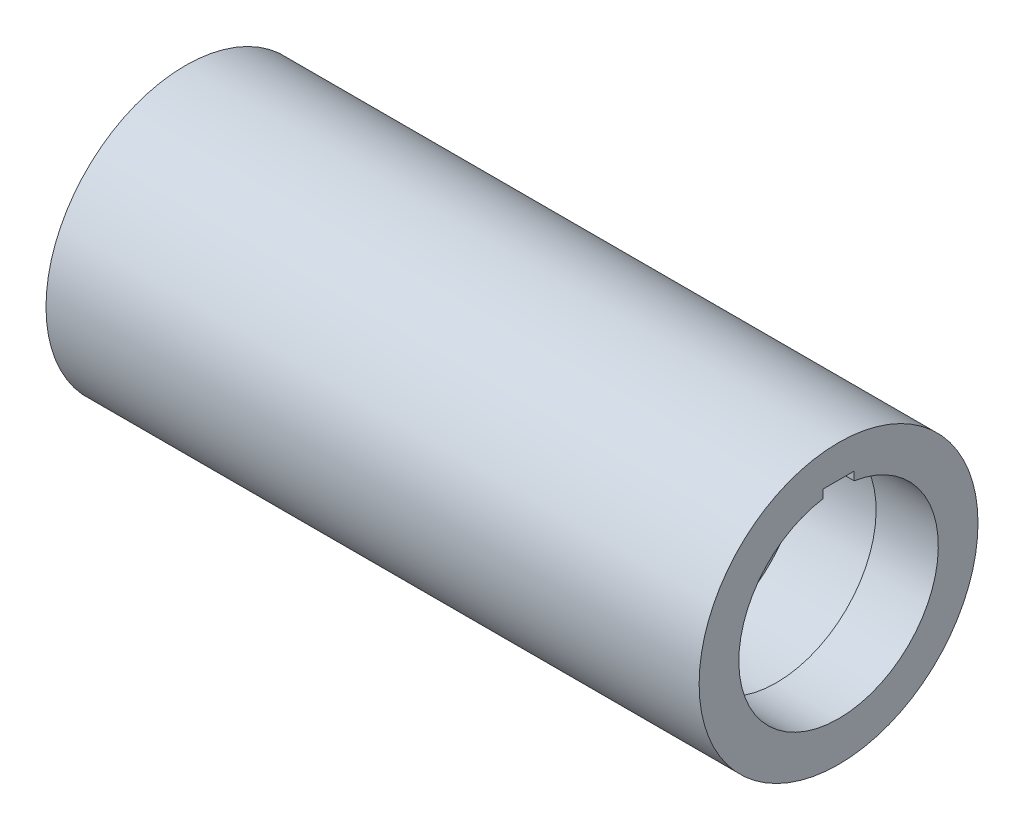
ISO-10303-21;
HEADER;
FILE_DESCRIPTION(('STEP AP214'),'2;1');
FILE_NAME('part.step','',(''),(''),'','','');
FILE_SCHEMA(('AUTOMOTIVE_DESIGN { 1 0 10303 214 1 1 1 1 }'));
ENDSEC;
DATA;
#1=APPLICATION_CONTEXT('core data for automotive mechanical design processes');
#2=APPLICATION_PROTOCOL_DEFINITION('international standard','automotive_design',2000,#1);
#3=PRODUCT_CONTEXT('',#1,'mechanical');
#4=PRODUCT('Part','Part','',(#3));
#5=PRODUCT_RELATED_PRODUCT_CATEGORY('part','',(#4));
#6=PRODUCT_DEFINITION_FORMATION('','',#4);
#7=PRODUCT_DEFINITION_CONTEXT('part definition',#1,'design');
#8=PRODUCT_DEFINITION('design','',#6,#7);
#9=PRODUCT_DEFINITION_SHAPE('','',#8);
#10=(LENGTH_UNIT() NAMED_UNIT(*) SI_UNIT(.MILLI.,.METRE.));
#11=(NAMED_UNIT(*) PLANE_ANGLE_UNIT() SI_UNIT($,.RADIAN.));
#12=(NAMED_UNIT(*) SI_UNIT($,.STERADIAN.) SOLID_ANGLE_UNIT());
#13=UNCERTAINTY_MEASURE_WITH_UNIT(LENGTH_MEASURE(1.E-05),#10,'distance_accuracy_value','');
#14=(GEOMETRIC_REPRESENTATION_CONTEXT(3) GLOBAL_UNCERTAINTY_ASSIGNED_CONTEXT((#13)) GLOBAL_UNIT_ASSIGNED_CONTEXT((#10,
#11,#12)) REPRESENTATION_CONTEXT('',''));
#15=CARTESIAN_POINT('',(0.,0.,0.));
#16=DIRECTION('',(0.,0.,1.));
#17=DIRECTION('',(1.,0.,0.));
#18=AXIS2_PLACEMENT_3D('',#15,#16,#17);
#19=CARTESIAN_POINT('',(-31.5,9.62162085033772,0.));
#20=DIRECTION('',(1.,0.,0.));
#21=DIRECTION('',(0.,0.,-1.));
#22=AXIS2_PLACEMENT_3D('',#19,#20,#21);
#23=PLANE('',#22);
#24=CARTESIAN_POINT('',(-31.5,0.,0.));
#25=DIRECTION('',(-1.,0.,0.));
#26=DIRECTION('',(0.,0.,1.));
#27=AXIS2_PLACEMENT_3D('',#24,#25,#26);
#28=CIRCLE('',#27,9.62162085033772);
#29=CARTESIAN_POINT('',(-31.5,9.50397747196687,-1.5));
#30=VERTEX_POINT('',#29);
#31=CARTESIAN_POINT('',(-31.5,9.50397747196687,1.5));
#32=VERTEX_POINT('',#31);
#33=EDGE_CURVE('E135',#30,#32,#28,.T.);
#34=ORIENTED_EDGE('',*,*,#33,.F.);
#35=DIRECTION('',(0.,1.,0.));
#36=VECTOR('',#35,1.);
#37=CARTESIAN_POINT('',(-31.5,10.3118691564843,-1.5));
#38=LINE('',#37,#36);
#39=CARTESIAN_POINT('',(-31.5,10.3118691564843,-1.5));
#40=VERTEX_POINT('',#39);
#41=EDGE_CURVE('E116',#30,#40,#38,.T.);
#42=ORIENTED_EDGE('',*,*,#41,.T.);
#43=DIRECTION('',(0.,0.,1.));
#44=VECTOR('',#43,1.);
#45=CARTESIAN_POINT('',(-31.5,10.3118691564843,1.5));
#46=LINE('',#45,#44);
#47=CARTESIAN_POINT('',(-31.5,10.3118691564843,1.5));
#48=VERTEX_POINT('',#47);
#49=EDGE_CURVE('E124',#40,#48,#46,.T.);
#50=ORIENTED_EDGE('',*,*,#49,.T.);
#51=DIRECTION('',(0.,-1.,0.));
#52=VECTOR('',#51,1.);
#53=CARTESIAN_POINT('',(-31.5,10.3118691564843,1.5));
#54=LINE('',#53,#52);
#55=EDGE_CURVE('E130',#48,#32,#54,.T.);
#56=ORIENTED_EDGE('',*,*,#55,.T.);
#57=EDGE_LOOP('',(#34,#42,#50,#56));
#58=FACE_BOUND('',#57,.T.);
#59=CARTESIAN_POINT('',(-31.5,0.,0.));
#60=DIRECTION('',(-1.,0.,0.));
#61=DIRECTION('',(0.,0.,1.));
#62=AXIS2_PLACEMENT_3D('',#59,#60,#61);
#63=CIRCLE('',#62,13.45);
#64=CARTESIAN_POINT('',(-31.5,0.,13.45));
#65=VERTEX_POINT('',#64);
#66=EDGE_CURVE('E183',#65,#65,#63,.T.);
#67=ORIENTED_EDGE('',*,*,#66,.T.);
#68=EDGE_LOOP('',(#67));
#69=FACE_BOUND('',#68,.T.);
#70=ADVANCED_FACE('F48',(#58,#69),#23,.F.);
#71=CARTESIAN_POINT('',(-66.372744642719,0.,0.));
#72=DIRECTION('',(-1.,0.,0.));
#73=DIRECTION('',(0.,0.,1.));
#74=AXIS2_PLACEMENT_3D('',#71,#72,#73);
#75=CYLINDRICAL_SURFACE('',#74,13.45);
#76=ORIENTED_EDGE('',*,*,#66,.F.);
#77=EDGE_LOOP('',(#76));
#78=FACE_BOUND('',#77,.T.);
#79=CARTESIAN_POINT('',(31.5,0.,0.));
#80=DIRECTION('',(-1.,0.,0.));
#81=DIRECTION('',(0.,0.,1.));
#82=AXIS2_PLACEMENT_3D('',#79,#80,#81);
#83=CIRCLE('',#82,13.45);
#84=CARTESIAN_POINT('',(31.5,0.,13.45));
#85=VERTEX_POINT('',#84);
#86=EDGE_CURVE('E180',#85,#85,#83,.T.);
#87=ORIENTED_EDGE('',*,*,#86,.T.);
#88=EDGE_LOOP('',(#87));
#89=FACE_BOUND('',#88,.T.);
#90=ADVANCED_FACE('F207',(#78,#89),#75,.T.);
#91=CARTESIAN_POINT('',(31.5,13.45,0.));
#92=DIRECTION('',(-1.,0.,0.));
#93=DIRECTION('',(0.,0.,1.));
#94=AXIS2_PLACEMENT_3D('',#91,#92,#93);
#95=PLANE('',#94);
#96=ORIENTED_EDGE('',*,*,#86,.F.);
#97=EDGE_LOOP('',(#96));
#98=FACE_BOUND('',#97,.T.);
#99=DIRECTION('',(0.,0.,1.));
#100=VECTOR('',#99,1.);
#101=CARTESIAN_POINT('',(31.5,10.3118691564843,1.5));
#102=LINE('',#101,#100);
#103=CARTESIAN_POINT('',(31.5,10.3118691564843,-1.5));
#104=VERTEX_POINT('',#103);
#105=CARTESIAN_POINT('',(31.5,10.3118691564843,1.5));
#106=VERTEX_POINT('',#105);
#107=EDGE_CURVE('E138',#104,#106,#102,.T.);
#108=ORIENTED_EDGE('',*,*,#107,.F.);
#109=DIRECTION('',(0.,1.,0.));
#110=VECTOR('',#109,1.);
#111=CARTESIAN_POINT('',(31.5,10.3118691564843,-1.5));
#112=LINE('',#111,#110);
#113=CARTESIAN_POINT('',(31.5,9.50397747196687,-1.5));
#114=VERTEX_POINT('',#113);
#115=EDGE_CURVE('E142',#114,#104,#112,.T.);
#116=ORIENTED_EDGE('',*,*,#115,.F.);
#117=CARTESIAN_POINT('',(31.5,0.,0.));
#118=DIRECTION('',(-1.,0.,0.));
#119=DIRECTION('',(0.,0.,1.));
#120=AXIS2_PLACEMENT_3D('',#117,#118,#119);
#121=CIRCLE('',#120,9.62162085033772);
#122=CARTESIAN_POINT('',(31.5,9.50397747196687,1.5));
#123=VERTEX_POINT('',#122);
#124=EDGE_CURVE('E177',#114,#123,#121,.T.);
#125=ORIENTED_EDGE('',*,*,#124,.T.);
#126=DIRECTION('',(0.,-1.,0.));
#127=VECTOR('',#126,1.);
#128=CARTESIAN_POINT('',(31.5,10.3118691564843,1.5));
#129=LINE('',#128,#127);
#130=EDGE_CURVE('E136',#106,#123,#129,.T.);
#131=ORIENTED_EDGE('',*,*,#130,.F.);
#132=EDGE_LOOP('',(#108,#116,#125,#131));
#133=FACE_BOUND('',#132,.T.);
#134=ADVANCED_FACE('F211',(#98,#133),#95,.F.);
#135=CARTESIAN_POINT('',(-66.372744642719,0.,0.));
#136=DIRECTION('',(-1.,0.,0.));
#137=DIRECTION('',(0.,0.,1.));
#138=AXIS2_PLACEMENT_3D('',#135,#136,#137);
#139=CYLINDRICAL_SURFACE('',#138,9.62162085033773);
#140=ORIENTED_EDGE('',*,*,#124,.F.);
#141=DIRECTION('',(-1.,0.,0.));
#142=VECTOR('',#141,1.);
#143=CARTESIAN_POINT('',(-66.372744642719,9.50397747196687,-1.5));
#144=LINE('',#143,#142);
#145=CARTESIAN_POINT('',(25.5,9.50397747196688,-1.5));
#146=VERTEX_POINT('',#145);
#147=EDGE_CURVE('E158',#114,#146,#144,.T.);
#148=ORIENTED_EDGE('',*,*,#147,.T.);
#149=CARTESIAN_POINT('',(25.5,0.,0.));
#150=DIRECTION('',(-1.,0.,0.));
#151=DIRECTION('',(0.,0.,1.));
#152=AXIS2_PLACEMENT_3D('',#149,#150,#151);
#153=CIRCLE('',#152,9.62162085033775);
#154=CARTESIAN_POINT('',(25.5,9.50397747196688,1.5));
#155=VERTEX_POINT('',#154);
#156=EDGE_CURVE('E174',#146,#155,#153,.T.);
#157=ORIENTED_EDGE('',*,*,#156,.T.);
#158=DIRECTION('',(-1.,0.,0.));
#159=VECTOR('',#158,1.);
#160=CARTESIAN_POINT('',(-66.372744642719,9.50397747196687,1.5));
#161=LINE('',#160,#159);
#162=EDGE_CURVE('E151',#155,#123,#161,.F.);
#163=ORIENTED_EDGE('',*,*,#162,.T.);
#164=EDGE_LOOP('',(#140,#148,#157,#163));
#165=FACE_BOUND('',#164,.T.);
#166=ADVANCED_FACE('F216',(#165),#139,.F.);
#167=CARTESIAN_POINT('',(25.5,9.62162085033775,0.));
#168=DIRECTION('',(1.,0.,0.));
#169=DIRECTION('',(0.,0.,-1.));
#170=AXIS2_PLACEMENT_3D('',#167,#168,#169);
#171=PLANE('',#170);
#172=ORIENTED_EDGE('',*,*,#156,.F.);
#173=DIRECTION('',(0.,1.,0.));
#174=VECTOR('',#173,1.);
#175=CARTESIAN_POINT('',(25.5,9.62162085033775,-1.5));
#176=LINE('',#175,#174);
#177=CARTESIAN_POINT('',(25.5,10.3118691564843,-1.5));
#178=VERTEX_POINT('',#177);
#179=EDGE_CURVE('E155',#146,#178,#176,.T.);
#180=ORIENTED_EDGE('',*,*,#179,.T.);
#181=DIRECTION('',(0.,0.,1.));
#182=VECTOR('',#181,1.);
#183=CARTESIAN_POINT('',(25.5,10.3118691564843,0.));
#184=LINE('',#183,#182);
#185=CARTESIAN_POINT('',(25.5,10.3118691564843,1.5));
#186=VERTEX_POINT('',#185);
#187=EDGE_CURVE('E161',#178,#186,#184,.T.);
#188=ORIENTED_EDGE('',*,*,#187,.T.);
#189=DIRECTION('',(0.,-1.,0.));
#190=VECTOR('',#189,1.);
#191=CARTESIAN_POINT('',(25.5,9.62162085033775,1.5));
#192=LINE('',#191,#190);
#193=EDGE_CURVE('E148',#186,#155,#192,.T.);
#194=ORIENTED_EDGE('',*,*,#193,.T.);
#195=EDGE_LOOP('',(#172,#180,#188,#194));
#196=FACE_BOUND('',#195,.T.);
#197=CARTESIAN_POINT('',(25.5,0.,0.));
#198=DIRECTION('',(-1.,0.,0.));
#199=DIRECTION('',(0.,0.,1.));
#200=AXIS2_PLACEMENT_3D('',#197,#198,#199);
#201=CIRCLE('',#200,10.4216208503377);
#202=CARTESIAN_POINT('',(25.5,0.,10.4216208503377));
#203=VERTEX_POINT('',#202);
#204=EDGE_CURVE('E171',#203,#203,#201,.T.);
#205=ORIENTED_EDGE('',*,*,#204,.T.);
#206=EDGE_LOOP('',(#205));
#207=FACE_BOUND('',#206,.T.);
#208=ADVANCED_FACE('F224',(#196,#207),#171,.F.);
#209=CARTESIAN_POINT('',(-66.372744642719,0.,0.));
#210=DIRECTION('',(-1.,0.,0.));
#211=DIRECTION('',(0.,0.,1.));
#212=AXIS2_PLACEMENT_3D('',#209,#210,#211);
#213=CYLINDRICAL_SURFACE('',#212,10.4216208503377);
#214=ORIENTED_EDGE('',*,*,#204,.F.);
#215=EDGE_LOOP('',(#214));
#216=FACE_BOUND('',#215,.T.);
#217=CARTESIAN_POINT('',(17.5,0.,0.));
#218=DIRECTION('',(-1.,0.,0.));
#219=DIRECTION('',(0.,0.,1.));
#220=AXIS2_PLACEMENT_3D('',#217,#218,#219);
#221=CIRCLE('',#220,10.4216208503377);
#222=CARTESIAN_POINT('',(17.5,0.,10.4216208503377));
#223=VERTEX_POINT('',#222);
#224=EDGE_CURVE('E168',#223,#223,#221,.T.);
#225=ORIENTED_EDGE('',*,*,#224,.T.);
#226=EDGE_LOOP('',(#225));
#227=FACE_BOUND('',#226,.T.);
#228=ADVANCED_FACE('F228',(#216,#227),#213,.F.);
#229=CARTESIAN_POINT('',(17.5,10.4216208503377,0.));
#230=DIRECTION('',(-1.,0.,0.));
#231=DIRECTION('',(0.,0.,1.));
#232=AXIS2_PLACEMENT_3D('',#229,#230,#231);
#233=PLANE('',#232);
#234=ORIENTED_EDGE('',*,*,#224,.F.);
#235=EDGE_LOOP('',(#234));
#236=FACE_BOUND('',#235,.T.);
#237=DIRECTION('',(0.,0.,-1.));
#238=VECTOR('',#237,1.);
#239=CARTESIAN_POINT('',(17.5,10.3118691564843,0.));
#240=LINE('',#239,#238);
#241=CARTESIAN_POINT('',(17.5,10.3118691564843,1.5));
#242=VERTEX_POINT('',#241);
#243=CARTESIAN_POINT('',(17.5,10.3118691564843,-1.5));
#244=VERTEX_POINT('',#243);
#245=EDGE_CURVE('E13',#242,#244,#240,.T.);
#246=ORIENTED_EDGE('',*,*,#245,.T.);
#247=DIRECTION('',(0.,-1.,0.));
#248=VECTOR('',#247,1.);
#249=CARTESIAN_POINT('',(17.5,10.4216208503377,-1.5));
#250=LINE('',#249,#248);
#251=CARTESIAN_POINT('',(17.5,9.50397747196687,-1.5));
#252=VERTEX_POINT('',#251);
#253=EDGE_CURVE('E119',#244,#252,#250,.T.);
#254=ORIENTED_EDGE('',*,*,#253,.T.);
#255=CARTESIAN_POINT('',(17.5,0.,0.));
#256=DIRECTION('',(-1.,0.,0.));
#257=DIRECTION('',(0.,0.,1.));
#258=AXIS2_PLACEMENT_3D('',#255,#256,#257);
#259=CIRCLE('',#258,9.62162085033775);
#260=CARTESIAN_POINT('',(17.5,9.50397747196688,1.5));
#261=VERTEX_POINT('',#260);
#262=EDGE_CURVE('E165',#252,#261,#259,.T.);
#263=ORIENTED_EDGE('',*,*,#262,.T.);
#264=DIRECTION('',(0.,1.,0.));
#265=VECTOR('',#264,1.);
#266=CARTESIAN_POINT('',(17.5,10.4216208503377,1.5));
#267=LINE('',#266,#265);
#268=EDGE_CURVE('E70',#261,#242,#267,.T.);
#269=ORIENTED_EDGE('',*,*,#268,.T.);
#270=EDGE_LOOP('',(#246,#254,#263,#269));
#271=FACE_BOUND('',#270,.T.);
#272=ADVANCED_FACE('F191',(#236,#271),#233,.F.);
#273=CARTESIAN_POINT('',(-66.372744642719,0.,0.));
#274=DIRECTION('',(-1.,0.,0.));
#275=DIRECTION('',(0.,0.,1.));
#276=AXIS2_PLACEMENT_3D('',#273,#274,#275);
#277=CYLINDRICAL_SURFACE('',#276,9.62162085033773);
#278=ORIENTED_EDGE('',*,*,#262,.F.);
#279=DIRECTION('',(-1.,0.,0.));
#280=VECTOR('',#279,1.);
#281=CARTESIAN_POINT('',(-66.372744642719,9.50397747196687,-1.5));
#282=LINE('',#281,#280);
#283=EDGE_CURVE('E55',#252,#30,#282,.T.);
#284=ORIENTED_EDGE('',*,*,#283,.T.);
#285=ORIENTED_EDGE('',*,*,#33,.T.);
#286=DIRECTION('',(-1.,0.,0.));
#287=VECTOR('',#286,1.);
#288=CARTESIAN_POINT('',(-66.372744642719,9.50397747196687,1.5));
#289=LINE('',#288,#287);
#290=EDGE_CURVE('E186',#32,#261,#289,.F.);
#291=ORIENTED_EDGE('',*,*,#290,.T.);
#292=EDGE_LOOP('',(#278,#284,#285,#291));
#293=FACE_BOUND('',#292,.T.);
#294=ADVANCED_FACE('F189',(#293),#277,.F.);
#295=CARTESIAN_POINT('',(-31.5,10.3118691564843,-1.5));
#296=DIRECTION('',(0.,0.,-1.));
#297=DIRECTION('',(0.,1.,0.));
#298=AXIS2_PLACEMENT_3D('',#295,#296,#297);
#299=PLANE('',#298);
#300=DIRECTION('',(1.,0.,0.));
#301=VECTOR('',#300,1.);
#302=CARTESIAN_POINT('',(-31.5,10.3118691564843,-1.5));
#303=LINE('',#302,#301);
#304=EDGE_CURVE('E112',#40,#244,#303,.T.);
#305=ORIENTED_EDGE('',*,*,#304,.F.);
#306=ORIENTED_EDGE('',*,*,#41,.F.);
#307=ORIENTED_EDGE('',*,*,#283,.F.);
#308=ORIENTED_EDGE('',*,*,#253,.F.);
#309=EDGE_LOOP('',(#305,#306,#307,#308));
#310=FACE_BOUND('',#309,.T.);
#311=ADVANCED_FACE('F114',(#310),#299,.F.);
#312=CARTESIAN_POINT('',(-31.5,10.3118691564843,1.5));
#313=DIRECTION('',(0.,0.,1.));
#314=DIRECTION('',(0.,-1.,0.));
#315=AXIS2_PLACEMENT_3D('',#312,#313,#314);
#316=PLANE('',#315);
#317=ORIENTED_EDGE('',*,*,#290,.F.);
#318=ORIENTED_EDGE('',*,*,#55,.F.);
#319=DIRECTION('',(1.,0.,0.));
#320=VECTOR('',#319,1.);
#321=CARTESIAN_POINT('',(-31.5,10.3118691564843,1.5));
#322=LINE('',#321,#320);
#323=EDGE_CURVE('E126',#48,#242,#322,.T.);
#324=ORIENTED_EDGE('',*,*,#323,.T.);
#325=ORIENTED_EDGE('',*,*,#268,.F.);
#326=EDGE_LOOP('',(#317,#318,#324,#325));
#327=FACE_BOUND('',#326,.T.);
#328=ADVANCED_FACE('F192',(#327),#316,.F.);
#329=CARTESIAN_POINT('',(-31.5,10.3118691564843,1.5));
#330=DIRECTION('',(0.,1.,0.));
#331=DIRECTION('',(0.,0.,1.));
#332=AXIS2_PLACEMENT_3D('',#329,#330,#331);
#333=PLANE('',#332);
#334=ORIENTED_EDGE('',*,*,#323,.F.);
#335=ORIENTED_EDGE('',*,*,#49,.F.);
#336=ORIENTED_EDGE('',*,*,#304,.T.);
#337=ORIENTED_EDGE('',*,*,#245,.F.);
#338=EDGE_LOOP('',(#334,#335,#336,#337));
#339=FACE_BOUND('',#338,.T.);
#340=ADVANCED_FACE('F125',(#339),#333,.F.);
#341=EDGE_CURVE('E121',#178,#104,#303,.T.);
#342=ORIENTED_EDGE('',*,*,#341,.T.);
#343=ORIENTED_EDGE('',*,*,#107,.T.);
#344=EDGE_CURVE('E62',#186,#106,#322,.T.);
#345=ORIENTED_EDGE('',*,*,#344,.F.);
#346=ORIENTED_EDGE('',*,*,#187,.F.);
#347=EDGE_LOOP('',(#342,#343,#345,#346));
#348=FACE_BOUND('',#347,.T.);
#349=ADVANCED_FACE('F200',(#348),#333,.F.);
#350=ORIENTED_EDGE('',*,*,#115,.T.);
#351=ORIENTED_EDGE('',*,*,#341,.F.);
#352=ORIENTED_EDGE('',*,*,#179,.F.);
#353=ORIENTED_EDGE('',*,*,#147,.F.);
#354=EDGE_LOOP('',(#350,#351,#352,#353));
#355=FACE_BOUND('',#354,.T.);
#356=ADVANCED_FACE('F203',(#355),#299,.F.);
#357=ORIENTED_EDGE('',*,*,#193,.F.);
#358=ORIENTED_EDGE('',*,*,#344,.T.);
#359=ORIENTED_EDGE('',*,*,#130,.T.);
#360=ORIENTED_EDGE('',*,*,#162,.F.);
#361=EDGE_LOOP('',(#357,#358,#359,#360));
#362=FACE_BOUND('',#361,.T.);
#363=ADVANCED_FACE('F195',(#362),#316,.F.);
#364=CLOSED_SHELL('',(#70,#90,#134,#166,#208,#228,#272,#294,#311,#328,#340,#349,#356,#363));
#365=MANIFOLD_SOLID_BREP('B2',#364);
#366=ADVANCED_BREP_SHAPE_REPRESENTATION('',(#18,#365),#14);
#367=SHAPE_DEFINITION_REPRESENTATION(#9,#366);
ENDSEC;
END-ISO-10303-21;
